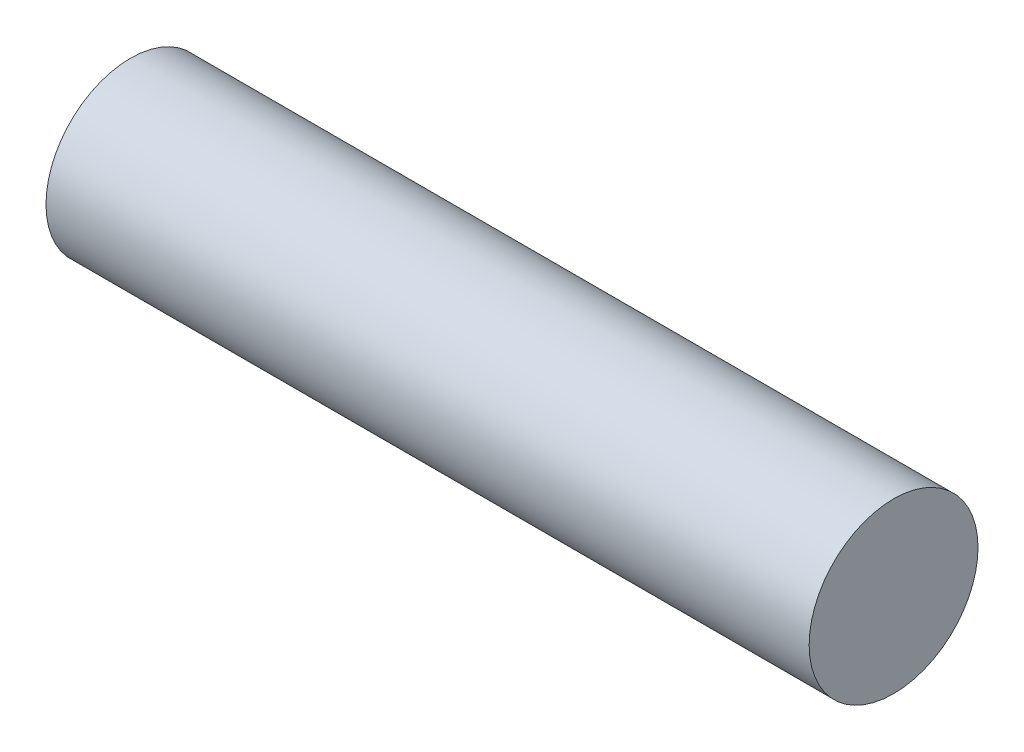
ISO-10303-21;
HEADER;
FILE_DESCRIPTION(('STEP AP214'),'2;1');
FILE_NAME('part.step','',(''),(''),'','','');
FILE_SCHEMA(('AUTOMOTIVE_DESIGN { 1 0 10303 214 1 1 1 1 }'));
ENDSEC;
DATA;
#1=APPLICATION_CONTEXT('core data for automotive mechanical design processes');
#2=APPLICATION_PROTOCOL_DEFINITION('international standard','automotive_design',2000,#1);
#3=PRODUCT_CONTEXT('',#1,'mechanical');
#4=PRODUCT('Part','Part','',(#3));
#5=PRODUCT_RELATED_PRODUCT_CATEGORY('part','',(#4));
#6=PRODUCT_DEFINITION_FORMATION('','',#4);
#7=PRODUCT_DEFINITION_CONTEXT('part definition',#1,'design');
#8=PRODUCT_DEFINITION('design','',#6,#7);
#9=PRODUCT_DEFINITION_SHAPE('','',#8);
#10=(LENGTH_UNIT() NAMED_UNIT(*) SI_UNIT(.MILLI.,.METRE.));
#11=(NAMED_UNIT(*) PLANE_ANGLE_UNIT() SI_UNIT($,.RADIAN.));
#12=(NAMED_UNIT(*) SI_UNIT($,.STERADIAN.) SOLID_ANGLE_UNIT());
#13=UNCERTAINTY_MEASURE_WITH_UNIT(LENGTH_MEASURE(1.E-05),#10,'distance_accuracy_value','');
#14=(GEOMETRIC_REPRESENTATION_CONTEXT(3) GLOBAL_UNCERTAINTY_ASSIGNED_CONTEXT((#13)) GLOBAL_UNIT_ASSIGNED_CONTEXT((#10,
#11,#12)) REPRESENTATION_CONTEXT('',''));
#15=CARTESIAN_POINT('',(0.,0.,0.));
#16=DIRECTION('',(0.,0.,1.));
#17=DIRECTION('',(1.,0.,0.));
#18=AXIS2_PLACEMENT_3D('',#15,#16,#17);
#19=CARTESIAN_POINT('',(14.351,0.,0.));
#20=DIRECTION('',(-1.,0.,0.));
#21=DIRECTION('',(0.,0.,1.));
#22=AXIS2_PLACEMENT_3D('',#19,#20,#21);
#23=CYLINDRICAL_SURFACE('',#22,3.175);
#24=CARTESIAN_POINT('',(14.351,0.,0.));
#25=DIRECTION('',(1.,0.,0.));
#26=DIRECTION('',(0.,0.,-1.));
#27=AXIS2_PLACEMENT_3D('',#24,#25,#26);
#28=CIRCLE('',#27,3.175);
#29=CARTESIAN_POINT('',(14.351,0.,-3.175));
#30=VERTEX_POINT('',#29);
#31=EDGE_CURVE('E10',#30,#30,#28,.T.);
#32=ORIENTED_EDGE('',*,*,#31,.F.);
#33=EDGE_LOOP('',(#32));
#34=FACE_BOUND('',#33,.T.);
#35=CARTESIAN_POINT('',(-14.351,0.,0.));
#36=DIRECTION('',(1.,0.,0.));
#37=DIRECTION('',(0.,0.,-1.));
#38=AXIS2_PLACEMENT_3D('',#35,#36,#37);
#39=CIRCLE('',#38,3.175);
#40=CARTESIAN_POINT('',(-14.351,0.,-3.175));
#41=VERTEX_POINT('',#40);
#42=EDGE_CURVE('E37',#41,#41,#39,.T.);
#43=ORIENTED_EDGE('',*,*,#42,.T.);
#44=EDGE_LOOP('',(#43));
#45=FACE_BOUND('',#44,.T.);
#46=ADVANCED_FACE('F34',(#34,#45),#23,.T.);
#47=CARTESIAN_POINT('',(14.351,0.,0.));
#48=DIRECTION('',(1.,0.,0.));
#49=DIRECTION('',(0.,0.,-1.));
#50=AXIS2_PLACEMENT_3D('',#47,#48,#49);
#51=PLANE('',#50);
#52=ORIENTED_EDGE('',*,*,#31,.T.);
#53=EDGE_LOOP('',(#52));
#54=FACE_BOUND('',#53,.T.);
#55=ADVANCED_FACE('F49',(#54),#51,.T.);
#56=CARTESIAN_POINT('',(-14.351,0.,0.));
#57=DIRECTION('',(1.,0.,0.));
#58=DIRECTION('',(0.,0.,-1.));
#59=AXIS2_PLACEMENT_3D('',#56,#57,#58);
#60=PLANE('',#59);
#61=ORIENTED_EDGE('',*,*,#42,.F.);
#62=EDGE_LOOP('',(#61));
#63=FACE_BOUND('',#62,.T.);
#64=ADVANCED_FACE('F47',(#63),#60,.F.);
#65=CLOSED_SHELL('',(#46,#55,#64));
#66=MANIFOLD_SOLID_BREP('B2',#65);
#67=ADVANCED_BREP_SHAPE_REPRESENTATION('',(#18,#66),#14);
#68=SHAPE_DEFINITION_REPRESENTATION(#9,#67);
ENDSEC;
END-ISO-10303-21;
